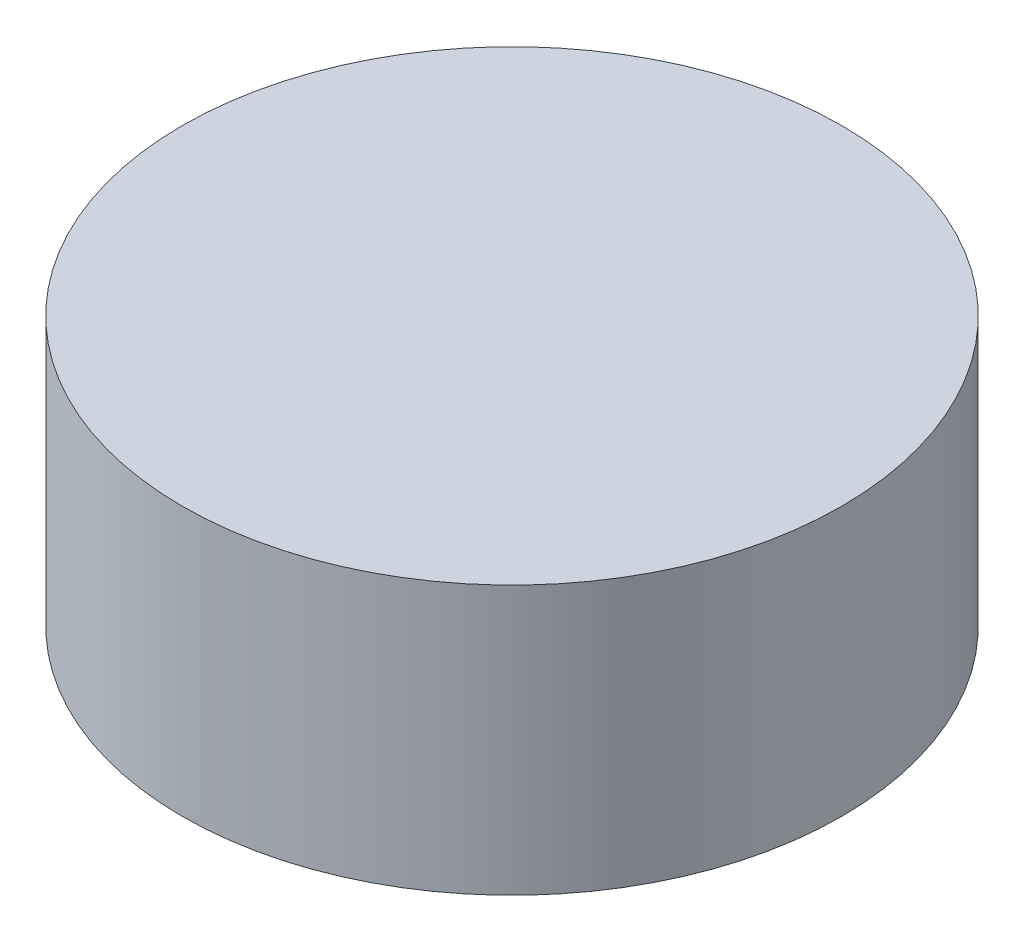
ISO-10303-21;
HEADER;
FILE_DESCRIPTION(('STEP AP214'),'2;1');
FILE_NAME('part.step','',(''),(''),'','','');
FILE_SCHEMA(('AUTOMOTIVE_DESIGN { 1 0 10303 214 1 1 1 1 }'));
ENDSEC;
DATA;
#1=APPLICATION_CONTEXT('core data for automotive mechanical design processes');
#2=APPLICATION_PROTOCOL_DEFINITION('international standard','automotive_design',2000,#1);
#3=PRODUCT_CONTEXT('',#1,'mechanical');
#4=PRODUCT('Part','Part','',(#3));
#5=PRODUCT_RELATED_PRODUCT_CATEGORY('part','',(#4));
#6=PRODUCT_DEFINITION_FORMATION('','',#4);
#7=PRODUCT_DEFINITION_CONTEXT('part definition',#1,'design');
#8=PRODUCT_DEFINITION('design','',#6,#7);
#9=PRODUCT_DEFINITION_SHAPE('','',#8);
#10=(LENGTH_UNIT() NAMED_UNIT(*) SI_UNIT(.MILLI.,.METRE.));
#11=(NAMED_UNIT(*) PLANE_ANGLE_UNIT() SI_UNIT($,.RADIAN.));
#12=(NAMED_UNIT(*) SI_UNIT($,.STERADIAN.) SOLID_ANGLE_UNIT());
#13=UNCERTAINTY_MEASURE_WITH_UNIT(LENGTH_MEASURE(1.E-05),#10,'distance_accuracy_value','');
#14=(GEOMETRIC_REPRESENTATION_CONTEXT(3) GLOBAL_UNCERTAINTY_ASSIGNED_CONTEXT((#13)) GLOBAL_UNIT_ASSIGNED_CONTEXT((#10,
#11,#12)) REPRESENTATION_CONTEXT('',''));
#15=CARTESIAN_POINT('',(0.,0.,0.));
#16=DIRECTION('',(0.,0.,1.));
#17=DIRECTION('',(1.,0.,0.));
#18=AXIS2_PLACEMENT_3D('',#15,#16,#17);
#19=CARTESIAN_POINT('',(61.8643222732027,-152.3,84.6899338377505));
#20=DIRECTION('',(0.,-1.,0.));
#21=DIRECTION('',(0.,0.,-1.));
#22=AXIS2_PLACEMENT_3D('',#19,#20,#21);
#23=PLANE('',#22);
#24=CARTESIAN_POINT('',(98.6853222732027,-152.3,47.8689338377506));
#25=DIRECTION('',(0.,-1.,0.));
#26=DIRECTION('',(0.,0.,-1.));
#27=AXIS2_PLACEMENT_3D('',#24,#25,#26);
#28=CIRCLE('',#27,36.8200000000002);
#29=CARTESIAN_POINT('',(98.6853222732027,-152.3,11.0489338377504));
#30=VERTEX_POINT('',#29);
#31=EDGE_CURVE('E18',#30,#30,#28,.F.);
#32=ORIENTED_EDGE('',*,*,#31,.F.);
#33=EDGE_LOOP('',(#32));
#34=FACE_BOUND('',#33,.T.);
#35=ADVANCED_FACE('F14',(#34),#23,.T.);
#36=CARTESIAN_POINT('',(61.8643222732027,-122.3,11.0479338377505));
#37=DIRECTION('',(0.,1.,0.));
#38=DIRECTION('',(0.,0.,1.));
#39=AXIS2_PLACEMENT_3D('',#36,#37,#38);
#40=PLANE('',#39);
#41=CARTESIAN_POINT('',(98.6853222732027,-122.3,47.8689338377506));
#42=DIRECTION('',(0.,-1.,0.));
#43=DIRECTION('',(0.,0.,-1.));
#44=AXIS2_PLACEMENT_3D('',#41,#42,#43);
#45=CIRCLE('',#44,36.8200000000002);
#46=CARTESIAN_POINT('',(98.6853222732027,-122.3,11.0489338377504));
#47=VERTEX_POINT('',#46);
#48=EDGE_CURVE('E10',#47,#47,#45,.T.);
#49=ORIENTED_EDGE('',*,*,#48,.F.);
#50=EDGE_LOOP('',(#49));
#51=FACE_BOUND('',#50,.T.);
#52=ADVANCED_FACE('F32',(#51),#40,.T.);
#53=CARTESIAN_POINT('',(98.6853222732027,-122.3,47.8689338377506));
#54=DIRECTION('',(0.,-1.,0.));
#55=DIRECTION('',(0.,0.,-1.));
#56=AXIS2_PLACEMENT_3D('',#53,#54,#55);
#57=CYLINDRICAL_SURFACE('',#56,36.8200000000002);
#58=ORIENTED_EDGE('',*,*,#48,.T.);
#59=EDGE_LOOP('',(#58));
#60=FACE_BOUND('',#59,.T.);
#61=ORIENTED_EDGE('',*,*,#31,.T.);
#62=EDGE_LOOP('',(#61));
#63=FACE_BOUND('',#62,.T.);
#64=ADVANCED_FACE('F16',(#60,#63),#57,.T.);
#65=CLOSED_SHELL('',(#35,#52,#64));
#66=MANIFOLD_SOLID_BREP('B1',#65);
#67=ADVANCED_BREP_SHAPE_REPRESENTATION('',(#18,#66),#14);
#68=SHAPE_DEFINITION_REPRESENTATION(#9,#67);
ENDSEC;
END-ISO-10303-21;
